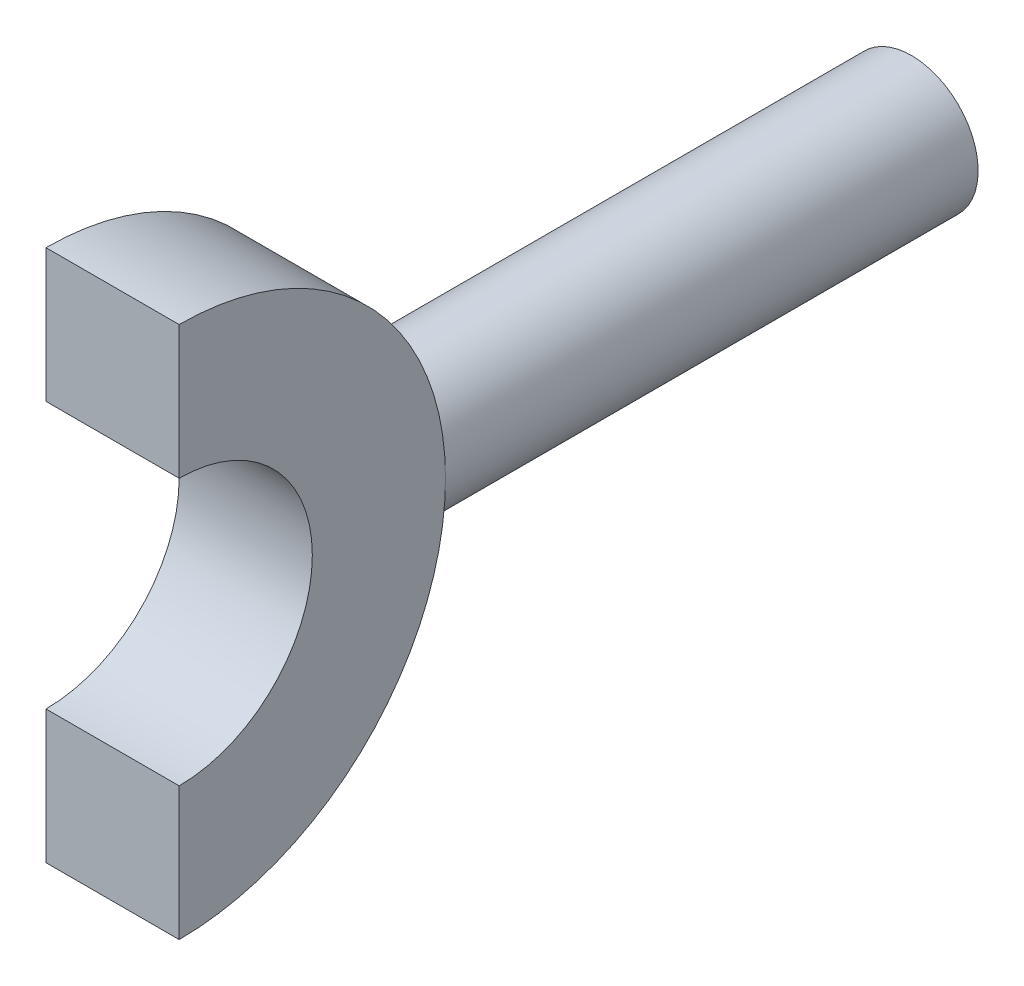
ISO-10303-21;
HEADER;
FILE_DESCRIPTION(('STEP AP214'),'2;1');
FILE_NAME('part.step','',(''),(''),'','','');
FILE_SCHEMA(('AUTOMOTIVE_DESIGN { 1 0 10303 214 1 1 1 1 }'));
ENDSEC;
DATA;
#1=APPLICATION_CONTEXT('core data for automotive mechanical design processes');
#2=APPLICATION_PROTOCOL_DEFINITION('international standard','automotive_design',2000,#1);
#3=PRODUCT_CONTEXT('',#1,'mechanical');
#4=PRODUCT('Part','Part','',(#3));
#5=PRODUCT_RELATED_PRODUCT_CATEGORY('part','',(#4));
#6=PRODUCT_DEFINITION_FORMATION('','',#4);
#7=PRODUCT_DEFINITION_CONTEXT('part definition',#1,'design');
#8=PRODUCT_DEFINITION('design','',#6,#7);
#9=PRODUCT_DEFINITION_SHAPE('','',#8);
#10=(LENGTH_UNIT() NAMED_UNIT(*) SI_UNIT(.MILLI.,.METRE.));
#11=(NAMED_UNIT(*) PLANE_ANGLE_UNIT() SI_UNIT($,.RADIAN.));
#12=(NAMED_UNIT(*) SI_UNIT($,.STERADIAN.) SOLID_ANGLE_UNIT());
#13=UNCERTAINTY_MEASURE_WITH_UNIT(LENGTH_MEASURE(1.E-05),#10,'distance_accuracy_value','');
#14=(GEOMETRIC_REPRESENTATION_CONTEXT(3) GLOBAL_UNCERTAINTY_ASSIGNED_CONTEXT((#13)) GLOBAL_UNIT_ASSIGNED_CONTEXT((#10,
#11,#12)) REPRESENTATION_CONTEXT('',''));
#15=CARTESIAN_POINT('',(0.,0.,0.));
#16=DIRECTION('',(0.,0.,1.));
#17=DIRECTION('',(1.,0.,0.));
#18=AXIS2_PLACEMENT_3D('',#15,#16,#17);
#19=CARTESIAN_POINT('',(2.5,0.,0.));
#20=DIRECTION('',(-1.,0.,0.));
#21=DIRECTION('',(0.,0.,1.));
#22=AXIS2_PLACEMENT_3D('',#19,#20,#21);
#23=CYLINDRICAL_SURFACE('',#22,10.);
#24=CARTESIAN_POINT('',(-2.5,0.,0.));
#25=DIRECTION('',(1.,0.,0.));
#26=DIRECTION('',(0.,0.,-1.));
#27=AXIS2_PLACEMENT_3D('',#24,#25,#26);
#28=CIRCLE('',#27,10.);
#29=CARTESIAN_POINT('',(-2.5,-10.,0.));
#30=VERTEX_POINT('',#29);
#31=CARTESIAN_POINT('',(-2.50000000000007,0.,-10.));
#32=VERTEX_POINT('',#31);
#33=EDGE_CURVE('E105',#30,#32,#28,.T.);
#34=ORIENTED_EDGE('',*,*,#33,.T.);
#35=CARTESIAN_POINT('',(-2.50000000000007,0.,-10.));
#36=CARTESIAN_POINT('',(-2.4999961237698,0.138126814449552,-9.99999766446687));
#37=CARTESIAN_POINT('',(-2.48851408204376,0.276296929717938,-9.99710963553044));
#38=CARTESIAN_POINT('',(-2.44295808115506,0.54867720628422,-9.98586856383157));
#39=CARTESIAN_POINT('',(-2.40887131743699,0.682885078117898,-9.97751242366627));
#40=CARTESIAN_POINT('',(-2.31926791089659,0.943368120304293,-9.9562604388672));
#41=CARTESIAN_POINT('',(-2.26377700214129,1.06965260571667,-9.94337004736764));
#42=CARTESIAN_POINT('',(-2.133031016592,1.31112021984071,-9.91442239679369));
#43=CARTESIAN_POINT('',(-2.05777527313512,1.4263029739146,-9.89836503090261));
#44=CARTESIAN_POINT('',(-1.88799868390977,1.64466987883486,-9.86445689319489));
#45=CARTESIAN_POINT('',(-1.7931473750683,1.74759281676843,-9.84657845246877));
#46=CARTESIAN_POINT('',(-1.58757965848501,1.93624821200553,-9.8112270019656));
#47=CARTESIAN_POINT('',(-1.47686146175518,2.02197872824865,-9.79375403816446));
#48=CARTESIAN_POINT('',(-1.24067462210508,2.17504423799829,-9.76091292830281));
#49=CARTESIAN_POINT('',(-1.11501128198552,2.2420870265419,-9.74557990774685));
#50=CARTESIAN_POINT('',(-0.853752647233344,2.35399484758457,-9.71915824696694));
#51=CARTESIAN_POINT('',(-0.71815894444671,2.39886342573357,-9.70806892824031));
#52=CARTESIAN_POINT('',(-0.443760836330636,2.46425806134127,-9.69167461160538));
#53=CARTESIAN_POINT('',(-0.305075173270082,2.48525378055342,-9.68625818328352));
#54=CARTESIAN_POINT('',(-0.0260523850011594,2.50376962511068,-9.68148937432652));
#55=CARTESIAN_POINT('',(0.11428446782016,2.50129356969685,-9.68213600713214));
#56=CARTESIAN_POINT('',(0.389026346242187,2.47331087439951,-9.68932009194695));
#57=CARTESIAN_POINT('',(0.523492702442149,2.44836390031772,-9.69571438345489));
#58=CARTESIAN_POINT('',(0.78626841818503,2.37704031150499,-9.71344516118448));
#59=CARTESIAN_POINT('',(0.914577338381467,2.33066217011565,-9.72478199948731));
#60=CARTESIAN_POINT('',(1.16289669375348,2.21731579656197,-9.75125189842765));
#61=CARTESIAN_POINT('',(1.28281028631588,2.1501444453882,-9.76642212449693));
#62=CARTESIAN_POINT('',(1.5098645162613,1.99726046002491,-9.79882851409985));
#63=CARTESIAN_POINT('',(1.61700291344535,1.91154458134806,-9.81606503891047));
#64=CARTESIAN_POINT('',(1.81867269282394,1.72110570780203,-9.85126467566485));
#65=CARTESIAN_POINT('',(1.91275748343552,1.61591043027643,-9.86923449130001));
#66=CARTESIAN_POINT('',(2.08203540410644,1.39101986250617,-9.90343275964594));
#67=CARTESIAN_POINT('',(2.15722795710587,1.27132412951324,-9.91966115915679));
#68=CARTESIAN_POINT('',(2.28675097704057,1.02019314780232,-9.94862886823651));
#69=CARTESIAN_POINT('',(2.34100890042398,0.88871898868104,-9.96135600212879));
#70=CARTESIAN_POINT('',(2.42652884284922,0.618126680238139,-9.98179861652361));
#71=CARTESIAN_POINT('',(2.45779526069683,0.479009998584143,-9.98951505565468));
#72=CARTESIAN_POINT('',(2.49576260926466,0.200899950650047,-9.99892498785624));
#73=CARTESIAN_POINT('',(2.50307171012543,0.0619945333136852,-10.0007675584713));
#74=CARTESIAN_POINT('',(2.49458499657412,-0.215054791335846,-9.99864674690754));
#75=CARTESIAN_POINT('',(2.47879126200137,-0.353198766074326,-9.99468388736421));
#76=CARTESIAN_POINT('',(2.4250484860143,-0.622690447960817,-9.98149301878918));
#77=CARTESIAN_POINT('',(2.38743122753831,-0.754108531614583,-9.97234390309647));
#78=CARTESIAN_POINT('',(2.29148819328583,-1.00876215408753,-9.94981177723595));
#79=CARTESIAN_POINT('',(2.23316032614456,-1.13199686505442,-9.93642833949965));
#80=CARTESIAN_POINT('',(2.09627311854214,-1.36920522404972,-9.9065551321037));
#81=CARTESIAN_POINT('',(2.01737314600566,-1.48297573639294,-9.89001445610999));
#82=CARTESIAN_POINT('',(1.84201681867132,-1.69587768940552,-9.85574181979586));
#83=CARTESIAN_POINT('',(1.74555743397052,-1.79500659828875,-9.83800965421578));
#84=CARTESIAN_POINT('',(1.53499673192709,-1.97831761345414,-9.80281594932498));
#85=CARTESIAN_POINT('',(1.42052049500066,-2.06207311270184,-9.78537173637463));
#86=CARTESIAN_POINT('',(1.1787789425523,-2.20918459835604,-9.75321463970069));
#87=CARTESIAN_POINT('',(1.05151419504919,-2.27254149026901,-9.73850163474941));
#88=CARTESIAN_POINT('',(0.788490462656202,-2.37658570101223,-9.71363491194665));
#89=CARTESIAN_POINT('',(0.652787286146102,-2.41740732773931,-9.70345425375809));
#90=CARTESIAN_POINT('',(0.37615060357444,-2.47557609990489,-9.68877906706586));
#91=CARTESIAN_POINT('',(0.235218248297516,-2.49292837912652,-9.68428329504044));
#92=CARTESIAN_POINT('',(-0.043535039769415,-2.50339765056083,-9.68158168701612));
#93=CARTESIAN_POINT('',(-0.181329058544146,-2.49719649630131,-9.68319887888034));
#94=CARTESIAN_POINT('',(-0.453839814443843,-2.46229546385366,-9.69213181672143));
#95=CARTESIAN_POINT('',(-0.588556613355387,-2.43359603781098,-9.69944744817732));
#96=CARTESIAN_POINT('',(-0.850347431776507,-2.35488553240495,-9.71885434473222));
#97=CARTESIAN_POINT('',(-0.977462175400617,-2.30500234113404,-9.73091692061057));
#98=CARTESIAN_POINT('',(-1.22160897118934,-2.18544152267504,-9.7584625954084));
#99=CARTESIAN_POINT('',(-1.33863962197821,-2.11576115005696,-9.77394616867808));
#100=CARTESIAN_POINT('',(-1.56259104833683,-1.95644624772858,-9.80709390439337));
#101=CARTESIAN_POINT('',(-1.66916845570668,-1.86633860485376,-9.82480441386302));
#102=CARTESIAN_POINT('',(-1.86591174132573,-1.66964895198289,-9.86013378743769));
#103=CARTESIAN_POINT('',(-1.95607371685501,-1.56306303543524,-9.87775262878422));
#104=CARTESIAN_POINT('',(-2.11901884760775,-1.33411264450432,-9.9112942607945));
#105=CARTESIAN_POINT('',(-2.1914576894527,-1.21149737052731,-9.92718055609783));
#106=CARTESIAN_POINT('',(-2.31457910490095,-0.955443432517459,-9.95508208291861));
#107=CARTESIAN_POINT('',(-2.36527726774763,-0.822012605727899,-9.96710008666301));
#108=CARTESIAN_POINT('',(-2.43595305054949,-0.574017088739119,-9.98413432609236));
#109=CARTESIAN_POINT('',(-2.45991873842246,-0.460633618180114,-9.99004308421151));
#110=CARTESIAN_POINT('',(-2.49194323936997,-0.231510119227139,-9.9979767538658));
#111=CARTESIAN_POINT('',(-2.50000324884224,-0.115770268737694,-10.0000019575149));
#112=CARTESIAN_POINT('',(-2.50000000000007,0.,-10.));
#113=B_SPLINE_CURVE_WITH_KNOTS('',3,(#35,#36,#37,#38,#39,#40,#41,#42,#43,#44,#45,#46,#47,#48,
#49,#50,#51,#52,#53,#54,#55,#56,#57,#58,#59,#60,#61,#62,#63,#64,#65,#66,#67,#68,#69,#70,#71,#72,
#73,#74,#75,#76,#77,#78,#79,#80,#81,#82,#83,#84,#85,#86,#87,#88,#89,#90,#91,#92,#93,#94,#95,#96,
#97,#98,#99,#100,#101,#102,#103,#104,#105,#106,#107,#108,#109,#110,#111,#112),.UNSPECIFIED.,.T.,
.F.,(4,2,2,2,2,2,2,2,2,2,2,2,2,2,2,2,2,2,2,2,2,2,2,2,2,2,2,2,2,2,2,2,2,2,2,2,2,2,4),(0.,
0.413956187453149,0.828147062939832,1.24184150381017,1.65554990028221,2.07690725728565,
2.4983121596677,2.92597745909678,3.35357435282281,3.77260491835116,4.19156730193363,
4.60037495017231,5.00921172448932,5.42217546462,5.83521151399139,6.26002501620567,
6.68485149269279,7.11113715020724,7.53734122819939,7.95263848254328,8.36789835193439,
8.7770045752893,9.18615212209352,9.60255979281121,10.0190393835223,10.4457418201299,
10.8724253125471,11.2965375769764,11.7205570543048,12.1323963400748,12.5442273493652,
12.9536066760888,13.3630428023797,13.7831596069298,14.2033761629383,14.6312030917578,
15.0587227304538,15.4057040491338,15.752659267482),.UNSPECIFIED.);
#114=CARTESIAN_POINT('',(2.49999999999993,0.,-10.));
#115=VERTEX_POINT('',#114);
#116=EDGE_CURVE('E55',#115,#32,#113,.T.);
#117=ORIENTED_EDGE('',*,*,#116,.F.);
#118=CARTESIAN_POINT('',(2.5,0.,0.));
#119=DIRECTION('',(1.,0.,0.));
#120=DIRECTION('',(0.,0.,-1.));
#121=AXIS2_PLACEMENT_3D('',#118,#119,#120);
#122=CIRCLE('',#121,10.);
#123=CARTESIAN_POINT('',(2.5,-10.,0.));
#124=VERTEX_POINT('',#123);
#125=EDGE_CURVE('E11',#124,#115,#122,.T.);
#126=ORIENTED_EDGE('',*,*,#125,.F.);
#127=DIRECTION('',(1.,0.,0.));
#128=VECTOR('',#127,1.);
#129=CARTESIAN_POINT('',(-2.5,-10.,0.));
#130=LINE('',#129,#128);
#131=EDGE_CURVE('E119',#30,#124,#130,.T.);
#132=ORIENTED_EDGE('',*,*,#131,.F.);
#133=EDGE_LOOP('',(#34,#117,#126,#132));
#134=FACE_BOUND('',#133,.T.);
#135=ADVANCED_FACE('F39',(#134),#23,.T.);
#136=CARTESIAN_POINT('',(2.5,10.,0.));
#137=VERTEX_POINT('',#136);
#138=EDGE_CURVE('E48',#115,#137,#122,.T.);
#139=ORIENTED_EDGE('',*,*,#138,.F.);
#140=EDGE_CURVE('E96',#32,#115,#113,.T.);
#141=ORIENTED_EDGE('',*,*,#140,.F.);
#142=CARTESIAN_POINT('',(-2.5,10.,0.));
#143=VERTEX_POINT('',#142);
#144=EDGE_CURVE('E63',#32,#143,#28,.T.);
#145=ORIENTED_EDGE('',*,*,#144,.T.);
#146=DIRECTION('',(1.,0.,0.));
#147=VECTOR('',#146,1.);
#148=CARTESIAN_POINT('',(-2.5,10.,0.));
#149=LINE('',#148,#147);
#150=EDGE_CURVE('E107',#143,#137,#149,.T.);
#151=ORIENTED_EDGE('',*,*,#150,.T.);
#152=EDGE_LOOP('',(#139,#141,#145,#151));
#153=FACE_BOUND('',#152,.T.);
#154=ADVANCED_FACE('F41',(#153),#23,.T.);
#155=CARTESIAN_POINT('',(2.5,0.,0.));
#156=DIRECTION('',(1.,0.,0.));
#157=DIRECTION('',(0.,0.,-1.));
#158=AXIS2_PLACEMENT_3D('',#155,#156,#157);
#159=PLANE('',#158);
#160=DIRECTION('',(0.,1.,0.));
#161=VECTOR('',#160,1.);
#162=CARTESIAN_POINT('',(2.5,-5.,0.));
#163=LINE('',#162,#161);
#164=CARTESIAN_POINT('',(2.5,-5.,0.));
#165=VERTEX_POINT('',#164);
#166=EDGE_CURVE('E113',#124,#165,#163,.T.);
#167=ORIENTED_EDGE('',*,*,#166,.F.);
#168=ORIENTED_EDGE('',*,*,#125,.T.);
#169=ORIENTED_EDGE('',*,*,#138,.T.);
#170=DIRECTION('',(0.,1.,0.));
#171=VECTOR('',#170,1.);
#172=CARTESIAN_POINT('',(2.5,5.,0.));
#173=LINE('',#172,#171);
#174=CARTESIAN_POINT('',(2.5,5.,0.));
#175=VERTEX_POINT('',#174);
#176=EDGE_CURVE('E114',#175,#137,#173,.T.);
#177=ORIENTED_EDGE('',*,*,#176,.F.);
#178=CARTESIAN_POINT('',(2.5,0.,0.));
#179=DIRECTION('',(1.,0.,0.));
#180=DIRECTION('',(0.,0.,-1.));
#181=AXIS2_PLACEMENT_3D('',#178,#179,#180);
#182=CIRCLE('',#181,5.);
#183=EDGE_CURVE('E43',#165,#175,#182,.T.);
#184=ORIENTED_EDGE('',*,*,#183,.F.);
#185=EDGE_LOOP('',(#167,#168,#169,#177,#184));
#186=FACE_BOUND('',#185,.T.);
#187=ADVANCED_FACE('F112',(#186),#159,.T.);
#188=CARTESIAN_POINT('',(-2.5,0.,0.));
#189=DIRECTION('',(1.,0.,0.));
#190=DIRECTION('',(0.,0.,-1.));
#191=AXIS2_PLACEMENT_3D('',#188,#189,#190);
#192=PLANE('',#191);
#193=ORIENTED_EDGE('',*,*,#33,.F.);
#194=DIRECTION('',(0.,1.,0.));
#195=VECTOR('',#194,1.);
#196=CARTESIAN_POINT('',(-2.5,-5.,0.));
#197=LINE('',#196,#195);
#198=CARTESIAN_POINT('',(-2.5,-5.,0.));
#199=VERTEX_POINT('',#198);
#200=EDGE_CURVE('E91',#30,#199,#197,.T.);
#201=ORIENTED_EDGE('',*,*,#200,.T.);
#202=CARTESIAN_POINT('',(-2.5,0.,0.));
#203=DIRECTION('',(1.,0.,0.));
#204=DIRECTION('',(0.,0.,-1.));
#205=AXIS2_PLACEMENT_3D('',#202,#203,#204);
#206=CIRCLE('',#205,5.);
#207=CARTESIAN_POINT('',(-2.5,5.,0.));
#208=VERTEX_POINT('',#207);
#209=EDGE_CURVE('E99',#199,#208,#206,.T.);
#210=ORIENTED_EDGE('',*,*,#209,.T.);
#211=DIRECTION('',(0.,1.,0.));
#212=VECTOR('',#211,1.);
#213=CARTESIAN_POINT('',(-2.5,5.,0.));
#214=LINE('',#213,#212);
#215=EDGE_CURVE('E125',#208,#143,#214,.T.);
#216=ORIENTED_EDGE('',*,*,#215,.T.);
#217=ORIENTED_EDGE('',*,*,#144,.F.);
#218=EDGE_LOOP('',(#193,#201,#210,#216,#217));
#219=FACE_BOUND('',#218,.T.);
#220=ADVANCED_FACE('F150',(#219),#192,.F.);
#221=CARTESIAN_POINT('',(-2.5,0.,0.));
#222=DIRECTION('',(1.,0.,0.));
#223=DIRECTION('',(0.,0.,-1.));
#224=AXIS2_PLACEMENT_3D('',#221,#222,#223);
#225=CYLINDRICAL_SURFACE('',#224,5.);
#226=ORIENTED_EDGE('',*,*,#183,.T.);
#227=DIRECTION('',(1.,0.,0.));
#228=VECTOR('',#227,1.);
#229=CARTESIAN_POINT('',(-2.5,5.,0.));
#230=LINE('',#229,#228);
#231=EDGE_CURVE('E120',#208,#175,#230,.T.);
#232=ORIENTED_EDGE('',*,*,#231,.F.);
#233=ORIENTED_EDGE('',*,*,#209,.F.);
#234=DIRECTION('',(1.,0.,0.));
#235=VECTOR('',#234,1.);
#236=CARTESIAN_POINT('',(-2.5,-5.,0.));
#237=LINE('',#236,#235);
#238=EDGE_CURVE('E87',#199,#165,#237,.T.);
#239=ORIENTED_EDGE('',*,*,#238,.T.);
#240=EDGE_LOOP('',(#226,#232,#233,#239));
#241=FACE_BOUND('',#240,.T.);
#242=ADVANCED_FACE('F143',(#241),#225,.F.);
#243=CARTESIAN_POINT('',(-2.5,-5.,0.));
#244=DIRECTION('',(0.,0.,-1.));
#245=DIRECTION('',(-1.,0.,0.));
#246=AXIS2_PLACEMENT_3D('',#243,#244,#245);
#247=PLANE('',#246);
#248=ORIENTED_EDGE('',*,*,#166,.T.);
#249=ORIENTED_EDGE('',*,*,#238,.F.);
#250=ORIENTED_EDGE('',*,*,#200,.F.);
#251=ORIENTED_EDGE('',*,*,#131,.T.);
#252=EDGE_LOOP('',(#248,#249,#250,#251));
#253=FACE_BOUND('',#252,.T.);
#254=ADVANCED_FACE('F139',(#253),#247,.F.);
#255=CARTESIAN_POINT('',(-2.5,5.,0.));
#256=DIRECTION('',(0.,0.,-1.));
#257=DIRECTION('',(-1.,0.,0.));
#258=AXIS2_PLACEMENT_3D('',#255,#256,#257);
#259=PLANE('',#258);
#260=ORIENTED_EDGE('',*,*,#176,.T.);
#261=ORIENTED_EDGE('',*,*,#150,.F.);
#262=ORIENTED_EDGE('',*,*,#215,.F.);
#263=ORIENTED_EDGE('',*,*,#231,.T.);
#264=EDGE_LOOP('',(#260,#261,#262,#263));
#265=FACE_BOUND('',#264,.T.);
#266=ADVANCED_FACE('F142',(#265),#259,.F.);
#267=CARTESIAN_POINT('',(-2.09467859724199E-13,0.,-30.));
#268=DIRECTION('',(0.,0.,-1.));
#269=DIRECTION('',(-1.,0.,0.));
#270=AXIS2_PLACEMENT_3D('',#267,#268,#269);
#271=PLANE('',#270);
#272=CARTESIAN_POINT('',(-2.09467859724199E-13,0.,-30.));
#273=DIRECTION('',(0.,0.,-1.));
#274=DIRECTION('',(-1.,0.,0.));
#275=AXIS2_PLACEMENT_3D('',#272,#273,#274);
#276=CIRCLE('',#275,2.5);
#277=CARTESIAN_POINT('',(-2.50000000000021,0.,-30.));
#278=VERTEX_POINT('',#277);
#279=EDGE_CURVE('E106',#278,#278,#276,.T.);
#280=ORIENTED_EDGE('',*,*,#279,.T.);
#281=EDGE_LOOP('',(#280));
#282=FACE_BOUND('',#281,.T.);
#283=ADVANCED_FACE('F146',(#282),#271,.T.);
#284=CARTESIAN_POINT('',(0.,0.,0.00200000000001588));
#285=DIRECTION('',(0.,0.,-1.));
#286=DIRECTION('',(-1.,0.,0.));
#287=AXIS2_PLACEMENT_3D('',#284,#285,#286);
#288=CYLINDRICAL_SURFACE('',#287,2.5);
#289=ORIENTED_EDGE('',*,*,#279,.F.);
#290=EDGE_LOOP('',(#289));
#291=FACE_BOUND('',#290,.T.);
#292=ORIENTED_EDGE('',*,*,#140,.T.);
#293=ORIENTED_EDGE('',*,*,#116,.T.);
#294=EDGE_LOOP('',(#292,#293));
#295=FACE_BOUND('',#294,.T.);
#296=ADVANCED_FACE('F97',(#291,#295),#288,.T.);
#297=CLOSED_SHELL('',(#135,#154,#187,#220,#242,#254,#266,#283,#296));
#298=MANIFOLD_SOLID_BREP('B2',#297);
#299=ADVANCED_BREP_SHAPE_REPRESENTATION('',(#18,#298),#14);
#300=SHAPE_DEFINITION_REPRESENTATION(#9,#299);
ENDSEC;
END-ISO-10303-21;
